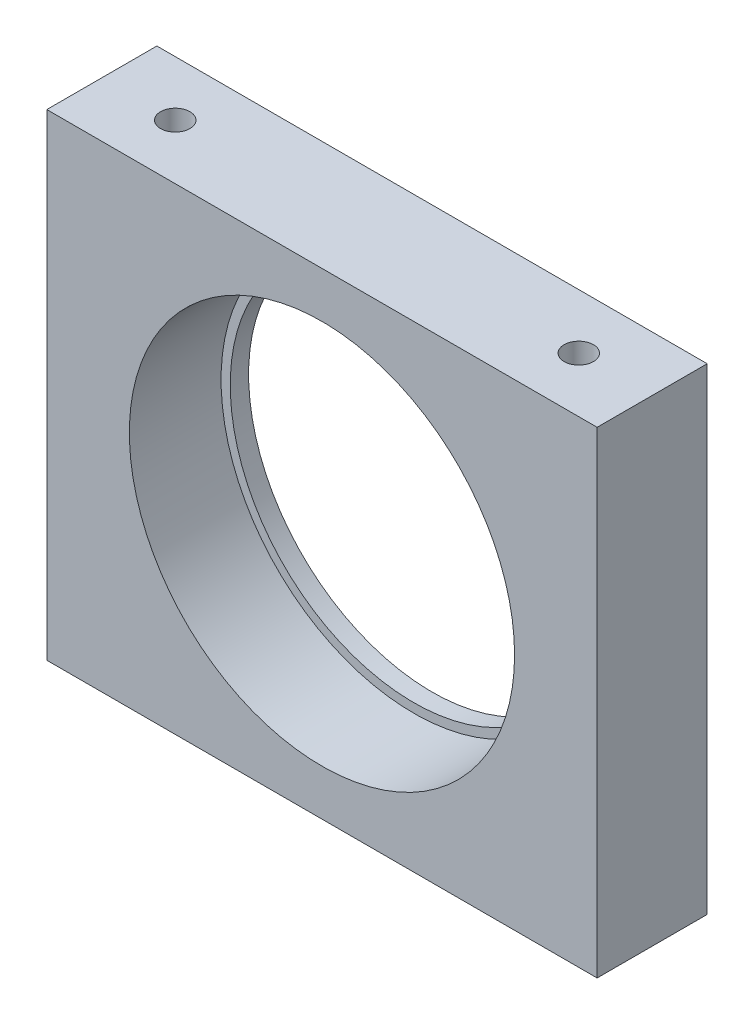
ISO-10303-21;
HEADER;
FILE_DESCRIPTION(('STEP AP214'),'2;1');
FILE_NAME('part.step','',(''),(''),'','','');
FILE_SCHEMA(('AUTOMOTIVE_DESIGN { 1 0 10303 214 1 1 1 1 }'));
ENDSEC;
DATA;
#1=APPLICATION_CONTEXT('core data for automotive mechanical design processes');
#2=APPLICATION_PROTOCOL_DEFINITION('international standard','automotive_design',2000,#1);
#3=PRODUCT_CONTEXT('',#1,'mechanical');
#4=PRODUCT('Part','Part','',(#3));
#5=PRODUCT_RELATED_PRODUCT_CATEGORY('part','',(#4));
#6=PRODUCT_DEFINITION_FORMATION('','',#4);
#7=PRODUCT_DEFINITION_CONTEXT('part definition',#1,'design');
#8=PRODUCT_DEFINITION('design','',#6,#7);
#9=PRODUCT_DEFINITION_SHAPE('','',#8);
#10=(LENGTH_UNIT() NAMED_UNIT(*) SI_UNIT(.MILLI.,.METRE.));
#11=(NAMED_UNIT(*) PLANE_ANGLE_UNIT() SI_UNIT($,.RADIAN.));
#12=(NAMED_UNIT(*) SI_UNIT($,.STERADIAN.) SOLID_ANGLE_UNIT());
#13=UNCERTAINTY_MEASURE_WITH_UNIT(LENGTH_MEASURE(1.E-05),#10,'distance_accuracy_value','');
#14=(GEOMETRIC_REPRESENTATION_CONTEXT(3) GLOBAL_UNCERTAINTY_ASSIGNED_CONTEXT((#13)) GLOBAL_UNIT_ASSIGNED_CONTEXT((#10,
#11,#12)) REPRESENTATION_CONTEXT('',''));
#15=CARTESIAN_POINT('',(0.,0.,0.));
#16=DIRECTION('',(0.,0.,1.));
#17=DIRECTION('',(1.,0.,0.));
#18=AXIS2_PLACEMENT_3D('',#15,#16,#17);
#19=CARTESIAN_POINT('',(15.,13.,6.));
#20=DIRECTION('',(0.,0.,-1.));
#21=DIRECTION('',(-1.,0.,0.));
#22=AXIS2_PLACEMENT_3D('',#19,#20,#21);
#23=CYLINDRICAL_SURFACE('',#22,10.);
#24=CARTESIAN_POINT('',(15.,13.,0.));
#25=DIRECTION('',(0.,0.,1.));
#26=DIRECTION('',(1.,0.,0.));
#27=AXIS2_PLACEMENT_3D('',#24,#25,#26);
#28=CIRCLE('',#27,10.);
#29=CARTESIAN_POINT('',(25.,13.,0.));
#30=VERTEX_POINT('',#29);
#31=EDGE_CURVE('E133',#30,#30,#28,.T.);
#32=ORIENTED_EDGE('',*,*,#31,.F.);
#33=EDGE_LOOP('',(#32));
#34=FACE_BOUND('',#33,.T.);
#35=CARTESIAN_POINT('',(15.,13.,1.));
#36=DIRECTION('',(0.,0.,1.));
#37=DIRECTION('',(1.,0.,0.));
#38=AXIS2_PLACEMENT_3D('',#35,#36,#37);
#39=CIRCLE('',#38,10.);
#40=CARTESIAN_POINT('',(25.,13.,1.));
#41=VERTEX_POINT('',#40);
#42=EDGE_CURVE('E36',#41,#41,#39,.T.);
#43=ORIENTED_EDGE('',*,*,#42,.T.);
#44=EDGE_LOOP('',(#43));
#45=FACE_BOUND('',#44,.T.);
#46=ADVANCED_FACE('F32',(#34,#45),#23,.F.);
#47=CARTESIAN_POINT('',(0.,0.,6.));
#48=DIRECTION('',(0.,0.,-1.));
#49=DIRECTION('',(-1.,0.,0.));
#50=AXIS2_PLACEMENT_3D('',#47,#48,#49);
#51=PLANE('',#50);
#52=CARTESIAN_POINT('',(15.,13.,6.));
#53=DIRECTION('',(0.,0.,1.));
#54=DIRECTION('',(1.,0.,0.));
#55=AXIS2_PLACEMENT_3D('',#52,#53,#54);
#56=CIRCLE('',#55,10.5);
#57=CARTESIAN_POINT('',(25.5,13.,6.));
#58=VERTEX_POINT('',#57);
#59=EDGE_CURVE('E127',#58,#58,#56,.T.);
#60=ORIENTED_EDGE('',*,*,#59,.F.);
#61=EDGE_LOOP('',(#60));
#62=FACE_BOUND('',#61,.T.);
#63=DIRECTION('',(0.,-1.,0.));
#64=VECTOR('',#63,1.);
#65=CARTESIAN_POINT('',(0.,0.,6.));
#66=LINE('',#65,#64);
#67=CARTESIAN_POINT('',(0.,26.,6.));
#68=VERTEX_POINT('',#67);
#69=CARTESIAN_POINT('',(0.,0.,6.));
#70=VERTEX_POINT('',#69);
#71=EDGE_CURVE('E137',#68,#70,#66,.T.);
#72=ORIENTED_EDGE('',*,*,#71,.T.);
#73=DIRECTION('',(1.,0.,0.));
#74=VECTOR('',#73,1.);
#75=CARTESIAN_POINT('',(0.,0.,6.));
#76=LINE('',#75,#74);
#77=CARTESIAN_POINT('',(30.,0.,6.));
#78=VERTEX_POINT('',#77);
#79=EDGE_CURVE('E81',#70,#78,#76,.T.);
#80=ORIENTED_EDGE('',*,*,#79,.T.);
#81=DIRECTION('',(0.,1.,0.));
#82=VECTOR('',#81,1.);
#83=CARTESIAN_POINT('',(30.,0.,6.));
#84=LINE('',#83,#82);
#85=CARTESIAN_POINT('',(30.,26.,6.));
#86=VERTEX_POINT('',#85);
#87=EDGE_CURVE('E140',#78,#86,#84,.T.);
#88=ORIENTED_EDGE('',*,*,#87,.T.);
#89=DIRECTION('',(-1.,0.,0.));
#90=VECTOR('',#89,1.);
#91=CARTESIAN_POINT('',(0.,26.,6.));
#92=LINE('',#91,#90);
#93=EDGE_CURVE('E50',#86,#68,#92,.T.);
#94=ORIENTED_EDGE('',*,*,#93,.T.);
#95=EDGE_LOOP('',(#72,#80,#88,#94));
#96=FACE_BOUND('',#95,.T.);
#97=ADVANCED_FACE('F180',(#62,#96),#51,.F.);
#98=CARTESIAN_POINT('',(0.,0.,0.));
#99=DIRECTION('',(0.,0.,-1.));
#100=DIRECTION('',(-1.,0.,0.));
#101=AXIS2_PLACEMENT_3D('',#98,#99,#100);
#102=PLANE('',#101);
#103=DIRECTION('',(0.,-1.,0.));
#104=VECTOR('',#103,1.);
#105=CARTESIAN_POINT('',(0.,0.,0.));
#106=LINE('',#105,#104);
#107=CARTESIAN_POINT('',(0.,26.,0.));
#108=VERTEX_POINT('',#107);
#109=CARTESIAN_POINT('',(0.,0.,0.));
#110=VERTEX_POINT('',#109);
#111=EDGE_CURVE('E136',#108,#110,#106,.T.);
#112=ORIENTED_EDGE('',*,*,#111,.F.);
#113=DIRECTION('',(-1.,0.,0.));
#114=VECTOR('',#113,1.);
#115=CARTESIAN_POINT('',(0.,26.,0.));
#116=LINE('',#115,#114);
#117=CARTESIAN_POINT('',(30.,26.,0.));
#118=VERTEX_POINT('',#117);
#119=EDGE_CURVE('E74',#118,#108,#116,.T.);
#120=ORIENTED_EDGE('',*,*,#119,.F.);
#121=DIRECTION('',(0.,1.,0.));
#122=VECTOR('',#121,1.);
#123=CARTESIAN_POINT('',(30.,0.,0.));
#124=LINE('',#123,#122);
#125=CARTESIAN_POINT('',(30.,0.,0.));
#126=VERTEX_POINT('',#125);
#127=EDGE_CURVE('E68',#126,#118,#124,.T.);
#128=ORIENTED_EDGE('',*,*,#127,.F.);
#129=DIRECTION('',(1.,0.,0.));
#130=VECTOR('',#129,1.);
#131=CARTESIAN_POINT('',(0.,0.,0.));
#132=LINE('',#131,#130);
#133=EDGE_CURVE('E146',#110,#126,#132,.T.);
#134=ORIENTED_EDGE('',*,*,#133,.F.);
#135=EDGE_LOOP('',(#112,#120,#128,#134));
#136=FACE_BOUND('',#135,.T.);
#137=ORIENTED_EDGE('',*,*,#31,.T.);
#138=EDGE_LOOP('',(#137));
#139=FACE_BOUND('',#138,.T.);
#140=ADVANCED_FACE('F157',(#136,#139),#102,.T.);
#141=CARTESIAN_POINT('',(0.,0.,6.));
#142=DIRECTION('',(1.,0.,0.));
#143=DIRECTION('',(0.,0.,-1.));
#144=AXIS2_PLACEMENT_3D('',#141,#142,#143);
#145=PLANE('',#144);
#146=ORIENTED_EDGE('',*,*,#111,.T.);
#147=DIRECTION('',(0.,0.,-1.));
#148=VECTOR('',#147,1.);
#149=CARTESIAN_POINT('',(0.,0.,6.));
#150=LINE('',#149,#148);
#151=EDGE_CURVE('E11',#70,#110,#150,.T.);
#152=ORIENTED_EDGE('',*,*,#151,.F.);
#153=ORIENTED_EDGE('',*,*,#71,.F.);
#154=DIRECTION('',(0.,0.,-1.));
#155=VECTOR('',#154,1.);
#156=CARTESIAN_POINT('',(0.,26.,6.));
#157=LINE('',#156,#155);
#158=EDGE_CURVE('E143',#68,#108,#157,.T.);
#159=ORIENTED_EDGE('',*,*,#158,.T.);
#160=EDGE_LOOP('',(#146,#152,#153,#159));
#161=FACE_BOUND('',#160,.T.);
#162=ADVANCED_FACE('F34',(#161),#145,.F.);
#163=CARTESIAN_POINT('',(0.,0.,6.));
#164=DIRECTION('',(0.,1.,0.));
#165=DIRECTION('',(0.,0.,1.));
#166=AXIS2_PLACEMENT_3D('',#163,#164,#165);
#167=PLANE('',#166);
#168=CARTESIAN_POINT('',(26.,0.,3.));
#169=DIRECTION('',(0.,-1.,0.));
#170=DIRECTION('',(0.,0.,-1.));
#171=AXIS2_PLACEMENT_3D('',#168,#169,#170);
#172=CIRCLE('',#171,0.799999999999999);
#173=CARTESIAN_POINT('',(26.,0.,2.2));
#174=VERTEX_POINT('',#173);
#175=EDGE_CURVE('E105',#174,#174,#172,.T.);
#176=ORIENTED_EDGE('',*,*,#175,.F.);
#177=EDGE_LOOP('',(#176));
#178=FACE_BOUND('',#177,.T.);
#179=CARTESIAN_POINT('',(4.,0.,3.));
#180=DIRECTION('',(0.,-1.,0.));
#181=DIRECTION('',(0.,0.,-1.));
#182=AXIS2_PLACEMENT_3D('',#179,#180,#181);
#183=CIRCLE('',#182,0.799999999999999);
#184=CARTESIAN_POINT('',(4.,0.,2.2));
#185=VERTEX_POINT('',#184);
#186=EDGE_CURVE('E104',#185,#185,#183,.T.);
#187=ORIENTED_EDGE('',*,*,#186,.F.);
#188=EDGE_LOOP('',(#187));
#189=FACE_BOUND('',#188,.T.);
#190=ORIENTED_EDGE('',*,*,#133,.T.);
#191=DIRECTION('',(0.,0.,-1.));
#192=VECTOR('',#191,1.);
#193=CARTESIAN_POINT('',(30.,0.,6.));
#194=LINE('',#193,#192);
#195=EDGE_CURVE('E42',#78,#126,#194,.T.);
#196=ORIENTED_EDGE('',*,*,#195,.F.);
#197=ORIENTED_EDGE('',*,*,#79,.F.);
#198=ORIENTED_EDGE('',*,*,#151,.T.);
#199=EDGE_LOOP('',(#190,#196,#197,#198));
#200=FACE_BOUND('',#199,.T.);
#201=ADVANCED_FACE('F174',(#178,#189,#200),#167,.F.);
#202=CARTESIAN_POINT('',(30.,0.,6.));
#203=DIRECTION('',(-1.,0.,0.));
#204=DIRECTION('',(0.,0.,1.));
#205=AXIS2_PLACEMENT_3D('',#202,#203,#204);
#206=PLANE('',#205);
#207=ORIENTED_EDGE('',*,*,#127,.T.);
#208=DIRECTION('',(0.,0.,-1.));
#209=VECTOR('',#208,1.);
#210=CARTESIAN_POINT('',(30.,26.,6.));
#211=LINE('',#210,#209);
#212=EDGE_CURVE('E151',#86,#118,#211,.T.);
#213=ORIENTED_EDGE('',*,*,#212,.F.);
#214=ORIENTED_EDGE('',*,*,#87,.F.);
#215=ORIENTED_EDGE('',*,*,#195,.T.);
#216=EDGE_LOOP('',(#207,#213,#214,#215));
#217=FACE_BOUND('',#216,.T.);
#218=ADVANCED_FACE('F154',(#217),#206,.F.);
#219=CARTESIAN_POINT('',(0.,26.,6.));
#220=DIRECTION('',(0.,-1.,0.));
#221=DIRECTION('',(0.,0.,-1.));
#222=AXIS2_PLACEMENT_3D('',#219,#220,#221);
#223=PLANE('',#222);
#224=CARTESIAN_POINT('',(4.,26.,3.));
#225=DIRECTION('',(0.,1.,0.));
#226=DIRECTION('',(0.,0.,1.));
#227=AXIS2_PLACEMENT_3D('',#224,#225,#226);
#228=CIRCLE('',#227,0.799999999999998);
#229=CARTESIAN_POINT('',(4.,26.,3.8));
#230=VERTEX_POINT('',#229);
#231=EDGE_CURVE('E115',#230,#230,#228,.T.);
#232=ORIENTED_EDGE('',*,*,#231,.F.);
#233=EDGE_LOOP('',(#232));
#234=FACE_BOUND('',#233,.T.);
#235=CARTESIAN_POINT('',(26.,26.,3.));
#236=DIRECTION('',(0.,1.,0.));
#237=DIRECTION('',(0.,0.,1.));
#238=AXIS2_PLACEMENT_3D('',#235,#236,#237);
#239=CIRCLE('',#238,0.799999999999999);
#240=CARTESIAN_POINT('',(26.,26.,3.8));
#241=VERTEX_POINT('',#240);
#242=EDGE_CURVE('E121',#241,#241,#239,.T.);
#243=ORIENTED_EDGE('',*,*,#242,.F.);
#244=EDGE_LOOP('',(#243));
#245=FACE_BOUND('',#244,.T.);
#246=ORIENTED_EDGE('',*,*,#119,.T.);
#247=ORIENTED_EDGE('',*,*,#158,.F.);
#248=ORIENTED_EDGE('',*,*,#93,.F.);
#249=ORIENTED_EDGE('',*,*,#212,.T.);
#250=EDGE_LOOP('',(#246,#247,#248,#249));
#251=FACE_BOUND('',#250,.T.);
#252=ADVANCED_FACE('F162',(#234,#245,#251),#223,.F.);
#253=CARTESIAN_POINT('',(15.,13.,1.));
#254=DIRECTION('',(0.,0.,1.));
#255=DIRECTION('',(1.,0.,0.));
#256=AXIS2_PLACEMENT_3D('',#253,#254,#255);
#257=CYLINDRICAL_SURFACE('',#256,10.5);
#258=CARTESIAN_POINT('',(15.,13.,1.));
#259=DIRECTION('',(0.,0.,1.));
#260=DIRECTION('',(1.,0.,0.));
#261=AXIS2_PLACEMENT_3D('',#258,#259,#260);
#262=CIRCLE('',#261,10.5);
#263=CARTESIAN_POINT('',(25.5,13.,1.));
#264=VERTEX_POINT('',#263);
#265=EDGE_CURVE('E128',#264,#264,#262,.T.);
#266=ORIENTED_EDGE('',*,*,#265,.F.);
#267=EDGE_LOOP('',(#266));
#268=FACE_BOUND('',#267,.T.);
#269=ORIENTED_EDGE('',*,*,#59,.T.);
#270=EDGE_LOOP('',(#269));
#271=FACE_BOUND('',#270,.T.);
#272=ADVANCED_FACE('F164',(#268,#271),#257,.F.);
#273=CARTESIAN_POINT('',(15.,13.,1.));
#274=DIRECTION('',(0.,0.,1.));
#275=DIRECTION('',(1.,0.,0.));
#276=AXIS2_PLACEMENT_3D('',#273,#274,#275);
#277=PLANE('',#276);
#278=ORIENTED_EDGE('',*,*,#42,.F.);
#279=EDGE_LOOP('',(#278));
#280=FACE_BOUND('',#279,.T.);
#281=ORIENTED_EDGE('',*,*,#265,.T.);
#282=EDGE_LOOP('',(#281));
#283=FACE_BOUND('',#282,.T.);
#284=ADVANCED_FACE('F171',(#280,#283),#277,.T.);
#285=CARTESIAN_POINT('',(26.,16.,3.));
#286=DIRECTION('',(0.,1.,0.));
#287=DIRECTION('',(0.,0.,1.));
#288=AXIS2_PLACEMENT_3D('',#285,#286,#287);
#289=CONICAL_SURFACE('',#288,0.799999999999995,1.02974425867665);
#290=CARTESIAN_POINT('',(26.,15.5193115047779,3.));
#291=VERTEX_POINT('',#290);
#292=VERTEX_LOOP('',#291);
#293=FACE_BOUND('',#292,.T.);
#294=CARTESIAN_POINT('',(26.,16.,3.));
#295=DIRECTION('',(0.,1.,0.));
#296=DIRECTION('',(0.,0.,1.));
#297=AXIS2_PLACEMENT_3D('',#294,#295,#296);
#298=CIRCLE('',#297,0.799999999999995);
#299=CARTESIAN_POINT('',(26.,16.,3.8));
#300=VERTEX_POINT('',#299);
#301=EDGE_CURVE('E124',#300,#300,#298,.T.);
#302=ORIENTED_EDGE('',*,*,#301,.T.);
#303=EDGE_LOOP('',(#302));
#304=FACE_BOUND('',#303,.T.);
#305=ADVANCED_FACE('F228',(#293,#304),#289,.F.);
#306=CARTESIAN_POINT('',(26.,26.,3.));
#307=DIRECTION('',(0.,1.,0.));
#308=DIRECTION('',(0.,0.,1.));
#309=AXIS2_PLACEMENT_3D('',#306,#307,#308);
#310=CYLINDRICAL_SURFACE('',#309,0.799999999999997);
#311=ORIENTED_EDGE('',*,*,#301,.F.);
#312=EDGE_LOOP('',(#311));
#313=FACE_BOUND('',#312,.T.);
#314=ORIENTED_EDGE('',*,*,#242,.T.);
#315=EDGE_LOOP('',(#314));
#316=FACE_BOUND('',#315,.T.);
#317=ADVANCED_FACE('F224',(#313,#316),#310,.F.);
#318=CARTESIAN_POINT('',(4.,16.,3.));
#319=DIRECTION('',(0.,1.,0.));
#320=DIRECTION('',(0.,0.,1.));
#321=AXIS2_PLACEMENT_3D('',#318,#319,#320);
#322=CONICAL_SURFACE('',#321,0.799999999999997,1.02974425867665);
#323=CARTESIAN_POINT('',(4.,15.5193115047779,3.));
#324=VERTEX_POINT('',#323);
#325=VERTEX_LOOP('',#324);
#326=FACE_BOUND('',#325,.T.);
#327=CARTESIAN_POINT('',(4.,16.,3.));
#328=DIRECTION('',(0.,1.,0.));
#329=DIRECTION('',(0.,0.,1.));
#330=AXIS2_PLACEMENT_3D('',#327,#328,#329);
#331=CIRCLE('',#330,0.799999999999997);
#332=CARTESIAN_POINT('',(4.,16.,3.8));
#333=VERTEX_POINT('',#332);
#334=EDGE_CURVE('E118',#333,#333,#331,.T.);
#335=ORIENTED_EDGE('',*,*,#334,.T.);
#336=EDGE_LOOP('',(#335));
#337=FACE_BOUND('',#336,.T.);
#338=ADVANCED_FACE('F220',(#326,#337),#322,.F.);
#339=CARTESIAN_POINT('',(4.,26.,3.));
#340=DIRECTION('',(0.,1.,0.));
#341=DIRECTION('',(0.,0.,1.));
#342=AXIS2_PLACEMENT_3D('',#339,#340,#341);
#343=CYLINDRICAL_SURFACE('',#342,0.799999999999997);
#344=ORIENTED_EDGE('',*,*,#334,.F.);
#345=EDGE_LOOP('',(#344));
#346=FACE_BOUND('',#345,.T.);
#347=ORIENTED_EDGE('',*,*,#231,.T.);
#348=EDGE_LOOP('',(#347));
#349=FACE_BOUND('',#348,.T.);
#350=ADVANCED_FACE('F212',(#346,#349),#343,.F.);
#351=CARTESIAN_POINT('',(4.,10.,3.));
#352=DIRECTION('',(0.,-1.,0.));
#353=DIRECTION('',(0.,0.,-1.));
#354=AXIS2_PLACEMENT_3D('',#351,#352,#353);
#355=CONICAL_SURFACE('',#354,0.799999999999998,1.02974425867665);
#356=CARTESIAN_POINT('',(4.,10.480688495222,3.));
#357=VERTEX_POINT('',#356);
#358=VERTEX_LOOP('',#357);
#359=FACE_BOUND('',#358,.T.);
#360=CARTESIAN_POINT('',(4.,10.,3.));
#361=DIRECTION('',(0.,-1.,0.));
#362=DIRECTION('',(0.,0.,-1.));
#363=AXIS2_PLACEMENT_3D('',#360,#361,#362);
#364=CIRCLE('',#363,0.799999999999998);
#365=CARTESIAN_POINT('',(4.,10.,2.2));
#366=VERTEX_POINT('',#365);
#367=EDGE_CURVE('E108',#366,#366,#364,.T.);
#368=ORIENTED_EDGE('',*,*,#367,.T.);
#369=EDGE_LOOP('',(#368));
#370=FACE_BOUND('',#369,.T.);
#371=ADVANCED_FACE('F206',(#359,#370),#355,.F.);
#372=CARTESIAN_POINT('',(4.,0.,3.));
#373=DIRECTION('',(0.,-1.,0.));
#374=DIRECTION('',(0.,0.,-1.));
#375=AXIS2_PLACEMENT_3D('',#372,#373,#374);
#376=CYLINDRICAL_SURFACE('',#375,0.799999999999998);
#377=ORIENTED_EDGE('',*,*,#367,.F.);
#378=EDGE_LOOP('',(#377));
#379=FACE_BOUND('',#378,.T.);
#380=ORIENTED_EDGE('',*,*,#186,.T.);
#381=EDGE_LOOP('',(#380));
#382=FACE_BOUND('',#381,.T.);
#383=ADVANCED_FACE('F98',(#379,#382),#376,.F.);
#384=CARTESIAN_POINT('',(26.,10.,3.));
#385=DIRECTION('',(0.,-1.,0.));
#386=DIRECTION('',(0.,0.,-1.));
#387=AXIS2_PLACEMENT_3D('',#384,#385,#386);
#388=CONICAL_SURFACE('',#387,0.799999999999999,1.02974425867665);
#389=CARTESIAN_POINT('',(26.,10.480688495222,3.));
#390=VERTEX_POINT('',#389);
#391=VERTEX_LOOP('',#390);
#392=FACE_BOUND('',#391,.T.);
#393=CARTESIAN_POINT('',(26.,10.,3.));
#394=DIRECTION('',(0.,-1.,0.));
#395=DIRECTION('',(0.,0.,-1.));
#396=AXIS2_PLACEMENT_3D('',#393,#394,#395);
#397=CIRCLE('',#396,0.799999999999999);
#398=CARTESIAN_POINT('',(26.,10.,2.2));
#399=VERTEX_POINT('',#398);
#400=EDGE_CURVE('E102',#399,#399,#397,.T.);
#401=ORIENTED_EDGE('',*,*,#400,.T.);
#402=EDGE_LOOP('',(#401));
#403=FACE_BOUND('',#402,.T.);
#404=ADVANCED_FACE('F94',(#392,#403),#388,.F.);
#405=CARTESIAN_POINT('',(26.,0.,3.));
#406=DIRECTION('',(0.,-1.,0.));
#407=DIRECTION('',(0.,0.,-1.));
#408=AXIS2_PLACEMENT_3D('',#405,#406,#407);
#409=CYLINDRICAL_SURFACE('',#408,0.799999999999999);
#410=ORIENTED_EDGE('',*,*,#400,.F.);
#411=EDGE_LOOP('',(#410));
#412=FACE_BOUND('',#411,.T.);
#413=ORIENTED_EDGE('',*,*,#175,.T.);
#414=EDGE_LOOP('',(#413));
#415=FACE_BOUND('',#414,.T.);
#416=ADVANCED_FACE('F97',(#412,#415),#409,.F.);
#417=CLOSED_SHELL('',(#46,#97,#140,#162,#201,#218,#252,#272,#284,#305,#317,#338,#350,#371,#383,
#404,#416));
#418=MANIFOLD_SOLID_BREP('B2',#417);
#419=ADVANCED_BREP_SHAPE_REPRESENTATION('',(#18,#418),#14);
#420=SHAPE_DEFINITION_REPRESENTATION(#9,#419);
ENDSEC;
END-ISO-10303-21;
